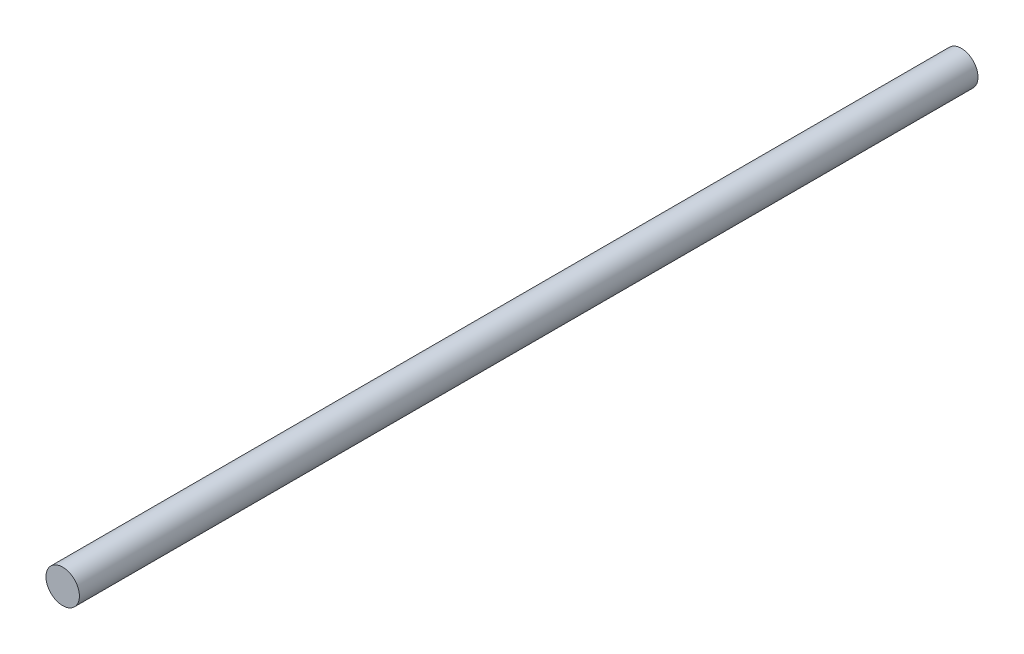
ISO-10303-21;
HEADER;
FILE_DESCRIPTION(('STEP AP214'),'2;1');
FILE_NAME('part.step','',(''),(''),'','','');
FILE_SCHEMA(('AUTOMOTIVE_DESIGN { 1 0 10303 214 1 1 1 1 }'));
ENDSEC;
DATA;
#1=APPLICATION_CONTEXT('core data for automotive mechanical design processes');
#2=APPLICATION_PROTOCOL_DEFINITION('international standard','automotive_design',2000,#1);
#3=PRODUCT_CONTEXT('',#1,'mechanical');
#4=PRODUCT('Part','Part','',(#3));
#5=PRODUCT_RELATED_PRODUCT_CATEGORY('part','',(#4));
#6=PRODUCT_DEFINITION_FORMATION('','',#4);
#7=PRODUCT_DEFINITION_CONTEXT('part definition',#1,'design');
#8=PRODUCT_DEFINITION('design','',#6,#7);
#9=PRODUCT_DEFINITION_SHAPE('','',#8);
#10=(LENGTH_UNIT() NAMED_UNIT(*) SI_UNIT(.MILLI.,.METRE.));
#11=(NAMED_UNIT(*) PLANE_ANGLE_UNIT() SI_UNIT($,.RADIAN.));
#12=(NAMED_UNIT(*) SI_UNIT($,.STERADIAN.) SOLID_ANGLE_UNIT());
#13=UNCERTAINTY_MEASURE_WITH_UNIT(LENGTH_MEASURE(1.E-05),#10,'distance_accuracy_value','');
#14=(GEOMETRIC_REPRESENTATION_CONTEXT(3) GLOBAL_UNCERTAINTY_ASSIGNED_CONTEXT((#13)) GLOBAL_UNIT_ASSIGNED_CONTEXT((#10,
#11,#12)) REPRESENTATION_CONTEXT('',''));
#15=CARTESIAN_POINT('',(0.,0.,0.));
#16=DIRECTION('',(0.,0.,1.));
#17=DIRECTION('',(1.,0.,0.));
#18=AXIS2_PLACEMENT_3D('',#15,#16,#17);
#19=CARTESIAN_POINT('',(0.,0.,269.));
#20=DIRECTION('',(0.,0.,-1.));
#21=DIRECTION('',(-1.,0.,0.));
#22=AXIS2_PLACEMENT_3D('',#19,#20,#21);
#23=CYLINDRICAL_SURFACE('',#22,5.);
#24=CARTESIAN_POINT('',(0.,0.,269.));
#25=DIRECTION('',(0.,0.,1.));
#26=DIRECTION('',(1.,0.,0.));
#27=AXIS2_PLACEMENT_3D('',#24,#25,#26);
#28=CIRCLE('',#27,5.);
#29=CARTESIAN_POINT('',(5.,0.,269.));
#30=VERTEX_POINT('',#29);
#31=EDGE_CURVE('E10',#30,#30,#28,.T.);
#32=ORIENTED_EDGE('',*,*,#31,.F.);
#33=EDGE_LOOP('',(#32));
#34=FACE_BOUND('',#33,.T.);
#35=CARTESIAN_POINT('',(0.,0.,0.));
#36=DIRECTION('',(0.,0.,1.));
#37=DIRECTION('',(1.,0.,0.));
#38=AXIS2_PLACEMENT_3D('',#35,#36,#37);
#39=CIRCLE('',#38,5.);
#40=CARTESIAN_POINT('',(5.,0.,0.));
#41=VERTEX_POINT('',#40);
#42=EDGE_CURVE('E35',#41,#41,#39,.T.);
#43=ORIENTED_EDGE('',*,*,#42,.T.);
#44=EDGE_LOOP('',(#43));
#45=FACE_BOUND('',#44,.T.);
#46=ADVANCED_FACE('F32',(#34,#45),#23,.T.);
#47=CARTESIAN_POINT('',(0.,0.,269.));
#48=DIRECTION('',(0.,0.,1.));
#49=DIRECTION('',(1.,0.,0.));
#50=AXIS2_PLACEMENT_3D('',#47,#48,#49);
#51=PLANE('',#50);
#52=ORIENTED_EDGE('',*,*,#31,.T.);
#53=EDGE_LOOP('',(#52));
#54=FACE_BOUND('',#53,.T.);
#55=ADVANCED_FACE('F47',(#54),#51,.T.);
#56=CARTESIAN_POINT('',(0.,0.,0.));
#57=DIRECTION('',(0.,0.,1.));
#58=DIRECTION('',(1.,0.,0.));
#59=AXIS2_PLACEMENT_3D('',#56,#57,#58);
#60=PLANE('',#59);
#61=ORIENTED_EDGE('',*,*,#42,.F.);
#62=EDGE_LOOP('',(#61));
#63=FACE_BOUND('',#62,.T.);
#64=ADVANCED_FACE('F45',(#63),#60,.F.);
#65=CLOSED_SHELL('',(#46,#55,#64));
#66=MANIFOLD_SOLID_BREP('B2',#65);
#67=ADVANCED_BREP_SHAPE_REPRESENTATION('',(#18,#66),#14);
#68=SHAPE_DEFINITION_REPRESENTATION(#9,#67);
ENDSEC;
END-ISO-10303-21;
